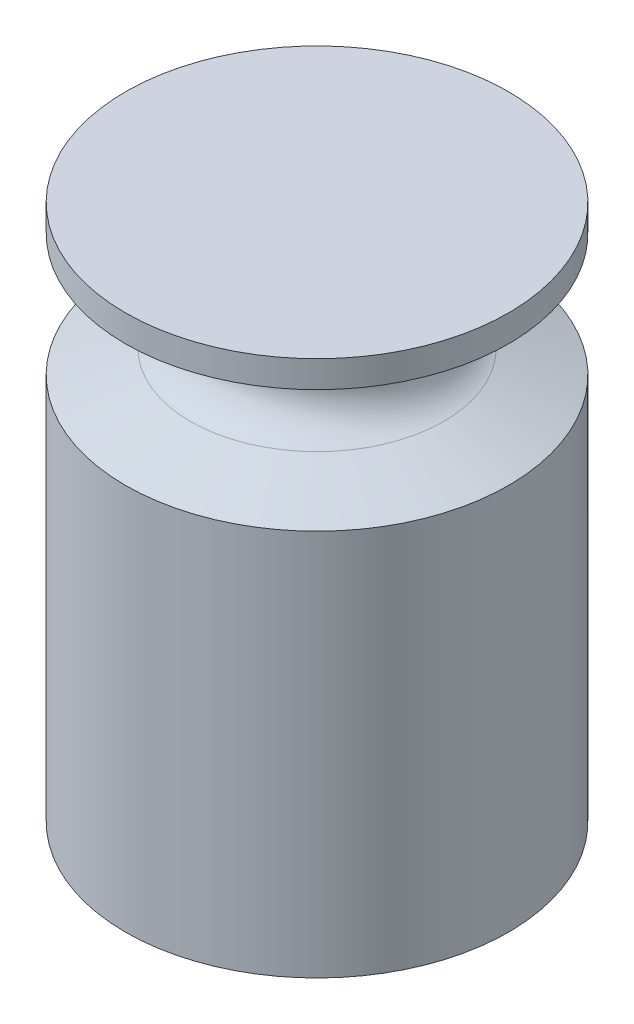
ISO-10303-21;
HEADER;
FILE_DESCRIPTION(('STEP AP214'),'2;1');
FILE_NAME('part.step','',(''),(''),'','','');
FILE_SCHEMA(('AUTOMOTIVE_DESIGN { 1 0 10303 214 1 1 1 1 }'));
ENDSEC;
DATA;
#1=APPLICATION_CONTEXT('core data for automotive mechanical design processes');
#2=APPLICATION_PROTOCOL_DEFINITION('international standard','automotive_design',2000,#1);
#3=PRODUCT_CONTEXT('',#1,'mechanical');
#4=PRODUCT('Part','Part','',(#3));
#5=PRODUCT_RELATED_PRODUCT_CATEGORY('part','',(#4));
#6=PRODUCT_DEFINITION_FORMATION('','',#4);
#7=PRODUCT_DEFINITION_CONTEXT('part definition',#1,'design');
#8=PRODUCT_DEFINITION('design','',#6,#7);
#9=PRODUCT_DEFINITION_SHAPE('','',#8);
#10=(LENGTH_UNIT() NAMED_UNIT(*) SI_UNIT(.MILLI.,.METRE.));
#11=(NAMED_UNIT(*) PLANE_ANGLE_UNIT() SI_UNIT($,.RADIAN.));
#12=(NAMED_UNIT(*) SI_UNIT($,.STERADIAN.) SOLID_ANGLE_UNIT());
#13=UNCERTAINTY_MEASURE_WITH_UNIT(LENGTH_MEASURE(1.E-05),#10,'distance_accuracy_value','');
#14=(GEOMETRIC_REPRESENTATION_CONTEXT(3) GLOBAL_UNCERTAINTY_ASSIGNED_CONTEXT((#13)) GLOBAL_UNIT_ASSIGNED_CONTEXT((#10,
#11,#12)) REPRESENTATION_CONTEXT('',''));
#15=CARTESIAN_POINT('',(0.,0.,0.));
#16=DIRECTION('',(0.,0.,1.));
#17=DIRECTION('',(1.,0.,0.));
#18=AXIS2_PLACEMENT_3D('',#15,#16,#17);
#19=CARTESIAN_POINT('',(0.,70.,0.));
#20=DIRECTION('',(0.,-1.,0.));
#21=DIRECTION('',(0.,0.,-1.));
#22=AXIS2_PLACEMENT_3D('',#19,#20,#21);
#23=CYLINDRICAL_SURFACE('',#22,25.);
#24=CARTESIAN_POINT('',(0.,0.,0.));
#25=DIRECTION('',(0.,1.,0.));
#26=DIRECTION('',(0.,0.,1.));
#27=AXIS2_PLACEMENT_3D('',#24,#25,#26);
#28=CIRCLE('',#27,25.);
#29=CARTESIAN_POINT('',(0.,0.,25.));
#30=VERTEX_POINT('',#29);
#31=EDGE_CURVE('E43',#30,#30,#28,.T.);
#32=ORIENTED_EDGE('',*,*,#31,.T.);
#33=EDGE_LOOP('',(#32));
#34=FACE_BOUND('',#33,.T.);
#35=CARTESIAN_POINT('',(0.,50.5,0.));
#36=DIRECTION('',(0.,1.,0.));
#37=DIRECTION('',(0.,0.,1.));
#38=AXIS2_PLACEMENT_3D('',#35,#36,#37);
#39=CIRCLE('',#38,25.);
#40=CARTESIAN_POINT('',(0.,50.5,25.));
#41=VERTEX_POINT('',#40);
#42=EDGE_CURVE('E52',#41,#41,#39,.T.);
#43=ORIENTED_EDGE('',*,*,#42,.F.);
#44=EDGE_LOOP('',(#43));
#45=FACE_BOUND('',#44,.T.);
#46=ADVANCED_FACE('F40',(#34,#45),#23,.T.);
#47=CARTESIAN_POINT('',(0.,0.,0.));
#48=DIRECTION('',(0.,1.,0.));
#49=DIRECTION('',(0.,0.,1.));
#50=AXIS2_PLACEMENT_3D('',#47,#48,#49);
#51=PLANE('',#50);
#52=ORIENTED_EDGE('',*,*,#31,.F.);
#53=EDGE_LOOP('',(#52));
#54=FACE_BOUND('',#53,.T.);
#55=ADVANCED_FACE('F87',(#54),#51,.F.);
#56=CARTESIAN_POINT('',(0.,53.5,0.));
#57=DIRECTION('',(0.,-1.,0.));
#58=DIRECTION('',(0.,0.,-1.));
#59=AXIS2_PLACEMENT_3D('',#56,#57,#58);
#60=CONICAL_SURFACE('',#59,16.5329917186279,1.23028133823032);
#61=ORIENTED_EDGE('',*,*,#42,.T.);
#62=EDGE_LOOP('',(#61));
#63=FACE_BOUND('',#62,.T.);
#64=CARTESIAN_POINT('',(0.,53.5,0.));
#65=DIRECTION('',(0.,1.,0.));
#66=DIRECTION('',(0.,0.,1.));
#67=AXIS2_PLACEMENT_3D('',#64,#65,#66);
#68=CIRCLE('',#67,16.5329917186279);
#69=CARTESIAN_POINT('',(0.,53.5,16.5329917186279));
#70=VERTEX_POINT('',#69);
#71=EDGE_CURVE('E57',#70,#70,#68,.T.);
#72=ORIENTED_EDGE('',*,*,#71,.F.);
#73=EDGE_LOOP('',(#72));
#74=FACE_BOUND('',#73,.T.);
#75=ADVANCED_FACE('F83',(#63,#74),#60,.T.);
#76=CARTESIAN_POINT('',(0.,58.5,0.));
#77=DIRECTION('',(0.,1.,0.));
#78=DIRECTION('',(0.,0.,1.));
#79=AXIS2_PLACEMENT_3D('',#76,#77,#78);
#80=TOROIDAL_SURFACE('',#79,18.304573781799,5.30457378179902);
#81=ORIENTED_EDGE('',*,*,#71,.T.);
#82=EDGE_LOOP('',(#81));
#83=FACE_BOUND('',#82,.T.);
#84=CARTESIAN_POINT('',(0.,63.5,0.));
#85=DIRECTION('',(0.,1.,0.));
#86=DIRECTION('',(0.,0.,1.));
#87=AXIS2_PLACEMENT_3D('',#84,#85,#86);
#88=CIRCLE('',#87,16.5329917186279);
#89=CARTESIAN_POINT('',(0.,63.5,16.5329917186279));
#90=VERTEX_POINT('',#89);
#91=EDGE_CURVE('E61',#90,#90,#88,.T.);
#92=ORIENTED_EDGE('',*,*,#91,.F.);
#93=EDGE_LOOP('',(#92));
#94=FACE_BOUND('',#93,.T.);
#95=ADVANCED_FACE('F75',(#83,#94),#80,.F.);
#96=CARTESIAN_POINT('',(0.,66.5,0.));
#97=DIRECTION('',(0.,1.,0.));
#98=DIRECTION('',(0.,0.,1.));
#99=AXIS2_PLACEMENT_3D('',#96,#97,#98);
#100=CONICAL_SURFACE('',#99,25.,1.23028133823032);
#101=ORIENTED_EDGE('',*,*,#91,.T.);
#102=EDGE_LOOP('',(#101));
#103=FACE_BOUND('',#102,.T.);
#104=CARTESIAN_POINT('',(0.,66.5,0.));
#105=DIRECTION('',(0.,1.,0.));
#106=DIRECTION('',(0.,0.,1.));
#107=AXIS2_PLACEMENT_3D('',#104,#105,#106);
#108=CIRCLE('',#107,25.);
#109=CARTESIAN_POINT('',(0.,66.5,25.));
#110=VERTEX_POINT('',#109);
#111=EDGE_CURVE('E65',#110,#110,#108,.T.);
#112=ORIENTED_EDGE('',*,*,#111,.F.);
#113=EDGE_LOOP('',(#112));
#114=FACE_BOUND('',#113,.T.);
#115=ADVANCED_FACE('F72',(#103,#114),#100,.T.);
#116=CARTESIAN_POINT('',(0.,70.,0.));
#117=DIRECTION('',(0.,1.,0.));
#118=DIRECTION('',(0.,0.,1.));
#119=AXIS2_PLACEMENT_3D('',#116,#117,#118);
#120=PLANE('',#119);
#121=CARTESIAN_POINT('',(0.,70.,0.));
#122=DIRECTION('',(0.,1.,0.));
#123=DIRECTION('',(0.,0.,1.));
#124=AXIS2_PLACEMENT_3D('',#121,#122,#123);
#125=CIRCLE('',#124,25.);
#126=CARTESIAN_POINT('',(0.,70.,25.));
#127=VERTEX_POINT('',#126);
#128=EDGE_CURVE('E10',#127,#127,#125,.T.);
#129=ORIENTED_EDGE('',*,*,#128,.T.);
#130=EDGE_LOOP('',(#129));
#131=FACE_BOUND('',#130,.T.);
#132=ADVANCED_FACE('F74',(#131),#120,.T.);
#133=ORIENTED_EDGE('',*,*,#128,.F.);
#134=EDGE_LOOP('',(#133));
#135=FACE_BOUND('',#134,.T.);
#136=ORIENTED_EDGE('',*,*,#111,.T.);
#137=EDGE_LOOP('',(#136));
#138=FACE_BOUND('',#137,.T.);
#139=ADVANCED_FACE('F70',(#135,#138),#23,.T.);
#140=CLOSED_SHELL('',(#46,#55,#75,#95,#115,#132,#139));
#141=MANIFOLD_SOLID_BREP('B2',#140);
#142=ADVANCED_BREP_SHAPE_REPRESENTATION('',(#18,#141),#14);
#143=SHAPE_DEFINITION_REPRESENTATION(#9,#142);
ENDSEC;
END-ISO-10303-21;
